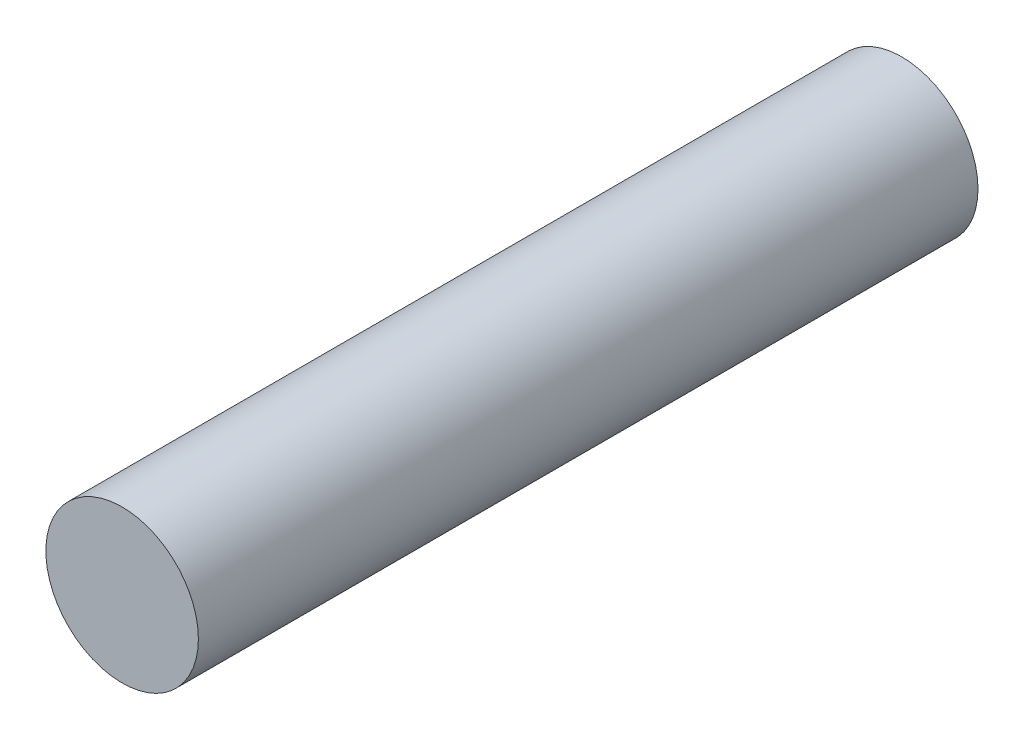
ISO-10303-21;
HEADER;
FILE_DESCRIPTION(('STEP AP214'),'2;1');
FILE_NAME('part.step','',(''),(''),'','','');
FILE_SCHEMA(('AUTOMOTIVE_DESIGN { 1 0 10303 214 1 1 1 1 }'));
ENDSEC;
DATA;
#1=APPLICATION_CONTEXT('core data for automotive mechanical design processes');
#2=APPLICATION_PROTOCOL_DEFINITION('international standard','automotive_design',2000,#1);
#3=PRODUCT_CONTEXT('',#1,'mechanical');
#4=PRODUCT('Part','Part','',(#3));
#5=PRODUCT_RELATED_PRODUCT_CATEGORY('part','',(#4));
#6=PRODUCT_DEFINITION_FORMATION('','',#4);
#7=PRODUCT_DEFINITION_CONTEXT('part definition',#1,'design');
#8=PRODUCT_DEFINITION('design','',#6,#7);
#9=PRODUCT_DEFINITION_SHAPE('','',#8);
#10=(LENGTH_UNIT() NAMED_UNIT(*) SI_UNIT(.MILLI.,.METRE.));
#11=(NAMED_UNIT(*) PLANE_ANGLE_UNIT() SI_UNIT($,.RADIAN.));
#12=(NAMED_UNIT(*) SI_UNIT($,.STERADIAN.) SOLID_ANGLE_UNIT());
#13=UNCERTAINTY_MEASURE_WITH_UNIT(LENGTH_MEASURE(1.E-05),#10,'distance_accuracy_value','');
#14=(GEOMETRIC_REPRESENTATION_CONTEXT(3) GLOBAL_UNCERTAINTY_ASSIGNED_CONTEXT((#13)) GLOBAL_UNIT_ASSIGNED_CONTEXT((#10,
#11,#12)) REPRESENTATION_CONTEXT('',''));
#15=CARTESIAN_POINT('',(0.,0.,0.));
#16=DIRECTION('',(0.,0.,1.));
#17=DIRECTION('',(1.,0.,0.));
#18=AXIS2_PLACEMENT_3D('',#15,#16,#17);
#19=CARTESIAN_POINT('',(0.,0.,23.));
#20=DIRECTION('',(0.,0.,-1.));
#21=DIRECTION('',(-1.,0.,0.));
#22=AXIS2_PLACEMENT_3D('',#19,#20,#21);
#23=CYLINDRICAL_SURFACE('',#22,2.25);
#24=CARTESIAN_POINT('',(0.,0.,23.));
#25=DIRECTION('',(0.,0.,1.));
#26=DIRECTION('',(1.,0.,0.));
#27=AXIS2_PLACEMENT_3D('',#24,#25,#26);
#28=CIRCLE('',#27,2.25);
#29=CARTESIAN_POINT('',(2.25,0.,23.));
#30=VERTEX_POINT('',#29);
#31=EDGE_CURVE('E11',#30,#30,#28,.T.);
#32=ORIENTED_EDGE('',*,*,#31,.F.);
#33=EDGE_LOOP('',(#32));
#34=FACE_BOUND('',#33,.T.);
#35=CARTESIAN_POINT('',(0.,0.,0.));
#36=DIRECTION('',(0.,0.,1.));
#37=DIRECTION('',(1.,0.,0.));
#38=AXIS2_PLACEMENT_3D('',#35,#36,#37);
#39=CIRCLE('',#38,2.25);
#40=CARTESIAN_POINT('',(2.25,0.,0.));
#41=VERTEX_POINT('',#40);
#42=EDGE_CURVE('E42',#41,#41,#39,.T.);
#43=ORIENTED_EDGE('',*,*,#42,.T.);
#44=EDGE_LOOP('',(#43));
#45=FACE_BOUND('',#44,.T.);
#46=ADVANCED_FACE('F39',(#34,#45),#23,.T.);
#47=CARTESIAN_POINT('',(0.,0.,23.));
#48=DIRECTION('',(0.,0.,1.));
#49=DIRECTION('',(1.,0.,0.));
#50=AXIS2_PLACEMENT_3D('',#47,#48,#49);
#51=PLANE('',#50);
#52=ORIENTED_EDGE('',*,*,#31,.T.);
#53=EDGE_LOOP('',(#52));
#54=FACE_BOUND('',#53,.T.);
#55=ADVANCED_FACE('F144',(#54),#51,.T.);
#56=CARTESIAN_POINT('',(0.,0.,0.));
#57=DIRECTION('',(0.,0.,1.));
#58=DIRECTION('',(1.,0.,0.));
#59=AXIS2_PLACEMENT_3D('',#56,#57,#58);
#60=PLANE('',#59);
#61=DIRECTION('',(-1.,0.,0.));
#62=VECTOR('',#61,1.);
#63=CARTESIAN_POINT('',(0.,-1.175,0.));
#64=LINE('',#63,#62);
#65=CARTESIAN_POINT('',(1.175,-1.175,0.));
#66=VERTEX_POINT('',#65);
#67=CARTESIAN_POINT('',(-1.175,-1.175,0.));
#68=VERTEX_POINT('',#67);
#69=EDGE_CURVE('E89',#66,#68,#64,.T.);
#70=ORIENTED_EDGE('',*,*,#69,.F.);
#71=DIRECTION('',(0.,-1.,0.));
#72=VECTOR('',#71,1.);
#73=CARTESIAN_POINT('',(1.175,0.,0.));
#74=LINE('',#73,#72);
#75=CARTESIAN_POINT('',(1.175,1.175,0.));
#76=VERTEX_POINT('',#75);
#77=EDGE_CURVE('E54',#76,#66,#74,.T.);
#78=ORIENTED_EDGE('',*,*,#77,.F.);
#79=DIRECTION('',(1.,0.,0.));
#80=VECTOR('',#79,1.);
#81=CARTESIAN_POINT('',(0.,1.175,0.));
#82=LINE('',#81,#80);
#83=CARTESIAN_POINT('',(-1.175,1.175,0.));
#84=VERTEX_POINT('',#83);
#85=EDGE_CURVE('E109',#84,#76,#82,.T.);
#86=ORIENTED_EDGE('',*,*,#85,.F.);
#87=DIRECTION('',(0.,1.,0.));
#88=VECTOR('',#87,1.);
#89=CARTESIAN_POINT('',(-1.175,0.,0.));
#90=LINE('',#89,#88);
#91=EDGE_CURVE('E118',#68,#84,#90,.T.);
#92=ORIENTED_EDGE('',*,*,#91,.F.);
#93=EDGE_LOOP('',(#70,#78,#86,#92));
#94=FACE_BOUND('',#93,.T.);
#95=ORIENTED_EDGE('',*,*,#42,.F.);
#96=EDGE_LOOP('',(#95));
#97=FACE_BOUND('',#96,.T.);
#98=ADVANCED_FACE('F129',(#94,#97),#60,.F.);
#99=CARTESIAN_POINT('',(1.175,0.,4.5));
#100=DIRECTION('',(1.,0.,0.));
#101=DIRECTION('',(0.,0.,-1.));
#102=AXIS2_PLACEMENT_3D('',#99,#100,#101);
#103=PLANE('',#102);
#104=ORIENTED_EDGE('',*,*,#77,.T.);
#105=DIRECTION('',(0.,0.,-1.));
#106=VECTOR('',#105,1.);
#107=CARTESIAN_POINT('',(1.175,-1.175,4.5));
#108=LINE('',#107,#106);
#109=CARTESIAN_POINT('',(1.175,-1.175,4.5));
#110=VERTEX_POINT('',#109);
#111=EDGE_CURVE('E77',#110,#66,#108,.T.);
#112=ORIENTED_EDGE('',*,*,#111,.F.);
#113=DIRECTION('',(0.,-1.,0.));
#114=VECTOR('',#113,1.);
#115=CARTESIAN_POINT('',(1.175,0.,4.5));
#116=LINE('',#115,#114);
#117=CARTESIAN_POINT('',(1.175,1.175,4.5));
#118=VERTEX_POINT('',#117);
#119=EDGE_CURVE('E105',#118,#110,#116,.T.);
#120=ORIENTED_EDGE('',*,*,#119,.F.);
#121=DIRECTION('',(0.,0.,-1.));
#122=VECTOR('',#121,1.);
#123=CARTESIAN_POINT('',(1.175,1.175,4.5));
#124=LINE('',#123,#122);
#125=EDGE_CURVE('E62',#118,#76,#124,.T.);
#126=ORIENTED_EDGE('',*,*,#125,.T.);
#127=EDGE_LOOP('',(#104,#112,#120,#126));
#128=FACE_BOUND('',#127,.T.);
#129=ADVANCED_FACE('F134',(#128),#103,.F.);
#130=CARTESIAN_POINT('',(0.,1.175,4.5));
#131=DIRECTION('',(0.,1.,0.));
#132=DIRECTION('',(-1.,0.,0.));
#133=AXIS2_PLACEMENT_3D('',#130,#131,#132);
#134=PLANE('',#133);
#135=ORIENTED_EDGE('',*,*,#85,.T.);
#136=ORIENTED_EDGE('',*,*,#125,.F.);
#137=DIRECTION('',(1.,0.,0.));
#138=VECTOR('',#137,1.);
#139=CARTESIAN_POINT('',(0.,1.175,4.5));
#140=LINE('',#139,#138);
#141=CARTESIAN_POINT('',(-1.175,1.175,4.5));
#142=VERTEX_POINT('',#141);
#143=EDGE_CURVE('E102',#142,#118,#140,.T.);
#144=ORIENTED_EDGE('',*,*,#143,.F.);
#145=DIRECTION('',(0.,0.,-1.));
#146=VECTOR('',#145,1.);
#147=CARTESIAN_POINT('',(-1.175,1.175,4.5));
#148=LINE('',#147,#146);
#149=EDGE_CURVE('E94',#142,#84,#148,.T.);
#150=ORIENTED_EDGE('',*,*,#149,.T.);
#151=EDGE_LOOP('',(#135,#136,#144,#150));
#152=FACE_BOUND('',#151,.T.);
#153=ADVANCED_FACE('F132',(#152),#134,.F.);
#154=CARTESIAN_POINT('',(-1.175,0.,4.5));
#155=DIRECTION('',(-1.,0.,0.));
#156=DIRECTION('',(0.,0.,1.));
#157=AXIS2_PLACEMENT_3D('',#154,#155,#156);
#158=PLANE('',#157);
#159=ORIENTED_EDGE('',*,*,#91,.T.);
#160=ORIENTED_EDGE('',*,*,#149,.F.);
#161=DIRECTION('',(0.,1.,0.));
#162=VECTOR('',#161,1.);
#163=CARTESIAN_POINT('',(-1.175,0.,4.5));
#164=LINE('',#163,#162);
#165=CARTESIAN_POINT('',(-1.175,-1.175,4.5));
#166=VERTEX_POINT('',#165);
#167=EDGE_CURVE('E97',#166,#142,#164,.T.);
#168=ORIENTED_EDGE('',*,*,#167,.F.);
#169=DIRECTION('',(0.,0.,-1.));
#170=VECTOR('',#169,1.);
#171=CARTESIAN_POINT('',(-1.175,-1.175,4.5));
#172=LINE('',#171,#170);
#173=EDGE_CURVE('E82',#166,#68,#172,.T.);
#174=ORIENTED_EDGE('',*,*,#173,.T.);
#175=EDGE_LOOP('',(#159,#160,#168,#174));
#176=FACE_BOUND('',#175,.T.);
#177=ADVANCED_FACE('F98',(#176),#158,.F.);
#178=CARTESIAN_POINT('',(0.,-1.175,4.5));
#179=DIRECTION('',(0.,-1.,0.));
#180=DIRECTION('',(0.,0.,-1.));
#181=AXIS2_PLACEMENT_3D('',#178,#179,#180);
#182=PLANE('',#181);
#183=ORIENTED_EDGE('',*,*,#69,.T.);
#184=ORIENTED_EDGE('',*,*,#173,.F.);
#185=DIRECTION('',(-1.,0.,0.));
#186=VECTOR('',#185,1.);
#187=CARTESIAN_POINT('',(0.,-1.175,4.5));
#188=LINE('',#187,#186);
#189=EDGE_CURVE('E86',#110,#166,#188,.T.);
#190=ORIENTED_EDGE('',*,*,#189,.F.);
#191=ORIENTED_EDGE('',*,*,#111,.T.);
#192=EDGE_LOOP('',(#183,#184,#190,#191));
#193=FACE_BOUND('',#192,.T.);
#194=ADVANCED_FACE('F84',(#193),#182,.F.);
#195=CARTESIAN_POINT('',(0.,0.,4.5));
#196=DIRECTION('',(0.,0.,-1.));
#197=DIRECTION('',(-1.,0.,0.));
#198=AXIS2_PLACEMENT_3D('',#195,#196,#197);
#199=PLANE('',#198);
#200=ORIENTED_EDGE('',*,*,#119,.T.);
#201=ORIENTED_EDGE('',*,*,#189,.T.);
#202=ORIENTED_EDGE('',*,*,#167,.T.);
#203=ORIENTED_EDGE('',*,*,#143,.T.);
#204=EDGE_LOOP('',(#200,#201,#202,#203));
#205=FACE_BOUND('',#204,.T.);
#206=ADVANCED_FACE('F104',(#205),#199,.T.);
#207=CLOSED_SHELL('',(#46,#55,#98,#129,#153,#177,#194,#206));
#208=MANIFOLD_SOLID_BREP('B2',#207);
#209=ADVANCED_BREP_SHAPE_REPRESENTATION('',(#18,#208),#14);
#210=SHAPE_DEFINITION_REPRESENTATION(#9,#209);
ENDSEC;
END-ISO-10303-21;
